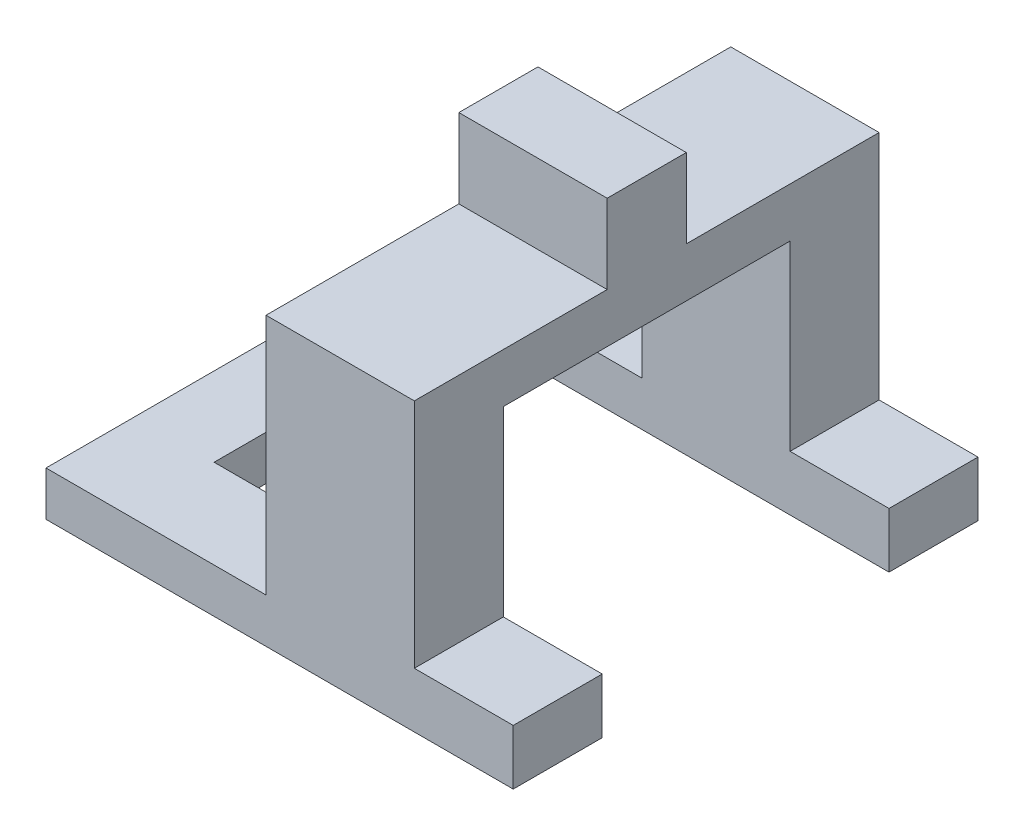
ISO-10303-21;
HEADER;
FILE_DESCRIPTION(('STEP AP214'),'2;1');
FILE_NAME('part.step','',(''),(''),'','','');
FILE_SCHEMA(('AUTOMOTIVE_DESIGN { 1 0 10303 214 1 1 1 1 }'));
ENDSEC;
DATA;
#1=APPLICATION_CONTEXT('core data for automotive mechanical design processes');
#2=APPLICATION_PROTOCOL_DEFINITION('international standard','automotive_design',2000,#1);
#3=PRODUCT_CONTEXT('',#1,'mechanical');
#4=PRODUCT('Part','Part','',(#3));
#5=PRODUCT_RELATED_PRODUCT_CATEGORY('part','',(#4));
#6=PRODUCT_DEFINITION_FORMATION('','',#4);
#7=PRODUCT_DEFINITION_CONTEXT('part definition',#1,'design');
#8=PRODUCT_DEFINITION('design','',#6,#7);
#9=PRODUCT_DEFINITION_SHAPE('','',#8);
#10=(LENGTH_UNIT() NAMED_UNIT(*) SI_UNIT(.MILLI.,.METRE.));
#11=(NAMED_UNIT(*) PLANE_ANGLE_UNIT() SI_UNIT($,.RADIAN.));
#12=(NAMED_UNIT(*) SI_UNIT($,.STERADIAN.) SOLID_ANGLE_UNIT());
#13=UNCERTAINTY_MEASURE_WITH_UNIT(LENGTH_MEASURE(1.E-05),#10,'distance_accuracy_value','');
#14=(GEOMETRIC_REPRESENTATION_CONTEXT(3) GLOBAL_UNCERTAINTY_ASSIGNED_CONTEXT((#13)) GLOBAL_UNIT_ASSIGNED_CONTEXT((#10,
#11,#12)) REPRESENTATION_CONTEXT('',''));
#15=CARTESIAN_POINT('',(0.,0.,0.));
#16=DIRECTION('',(0.,0.,1.));
#17=DIRECTION('',(1.,0.,0.));
#18=AXIS2_PLACEMENT_3D('',#15,#16,#17);
#19=CARTESIAN_POINT('',(18.1892801932367,-25.6304347826087,47.));
#20=DIRECTION('',(-1.,0.,0.));
#21=DIRECTION('',(0.,0.,1.));
#22=AXIS2_PLACEMENT_3D('',#19,#20,#21);
#23=PLANE('',#22);
#24=DIRECTION('',(0.,0.,-1.));
#25=VECTOR('',#24,1.);
#26=CARTESIAN_POINT('',(18.1892801932367,-25.6304347826087,47.));
#27=LINE('',#26,#25);
#28=CARTESIAN_POINT('',(18.1892801932367,-25.6304347826087,47.));
#29=VERTEX_POINT('',#28);
#30=CARTESIAN_POINT('',(18.1892801932367,-25.6304347826087,38.));
#31=VERTEX_POINT('',#30);
#32=EDGE_CURVE('E192',#29,#31,#27,.T.);
#33=ORIENTED_EDGE('',*,*,#32,.T.);
#34=DIRECTION('',(0.,-1.,0.));
#35=VECTOR('',#34,1.);
#36=CARTESIAN_POINT('',(18.1892801932367,-25.6304347826087,38.));
#37=LINE('',#36,#35);
#38=CARTESIAN_POINT('',(18.1892801932367,-20.0504347826087,38.));
#39=VERTEX_POINT('',#38);
#40=EDGE_CURVE('E133',#39,#31,#37,.T.);
#41=ORIENTED_EDGE('',*,*,#40,.F.);
#42=DIRECTION('',(0.,0.,-1.));
#43=VECTOR('',#42,1.);
#44=CARTESIAN_POINT('',(18.1892801932367,-20.0504347826087,47.));
#45=LINE('',#44,#43);
#46=CARTESIAN_POINT('',(18.1892801932367,-20.0504347826087,47.));
#47=VERTEX_POINT('',#46);
#48=EDGE_CURVE('E130',#47,#39,#45,.T.);
#49=ORIENTED_EDGE('',*,*,#48,.F.);
#50=DIRECTION('',(0.,1.,0.));
#51=VECTOR('',#50,1.);
#52=CARTESIAN_POINT('',(18.1892801932367,-25.6304347826087,47.));
#53=LINE('',#52,#51);
#54=EDGE_CURVE('E116',#29,#47,#53,.T.);
#55=ORIENTED_EDGE('',*,*,#54,.F.);
#56=EDGE_LOOP('',(#33,#41,#49,#55));
#57=FACE_BOUND('',#56,.T.);
#58=ADVANCED_FACE('F33',(#57),#23,.F.);
#59=CARTESIAN_POINT('',(18.1892801932367,-20.0504347826087,47.));
#60=DIRECTION('',(0.,-1.,0.));
#61=DIRECTION('',(0.,0.,-1.));
#62=AXIS2_PLACEMENT_3D('',#59,#60,#61);
#63=PLANE('',#62);
#64=ORIENTED_EDGE('',*,*,#48,.T.);
#65=DIRECTION('',(1.,0.,0.));
#66=VECTOR('',#65,1.);
#67=CARTESIAN_POINT('',(-21.0607198067633,-20.0504347826087,38.));
#68=LINE('',#67,#66);
#69=CARTESIAN_POINT('',(8.18928019323672,-20.0504347826087,38.));
#70=VERTEX_POINT('',#69);
#71=EDGE_CURVE('E332',#70,#39,#68,.T.);
#72=ORIENTED_EDGE('',*,*,#71,.F.);
#73=DIRECTION('',(0.,0.,-1.));
#74=VECTOR('',#73,1.);
#75=CARTESIAN_POINT('',(8.18928019323672,-20.0504347826087,47.));
#76=LINE('',#75,#74);
#77=CARTESIAN_POINT('',(8.18928019323672,-20.0504347826087,47.));
#78=VERTEX_POINT('',#77);
#79=EDGE_CURVE('E141',#78,#70,#76,.T.);
#80=ORIENTED_EDGE('',*,*,#79,.F.);
#81=DIRECTION('',(-1.,0.,0.));
#82=VECTOR('',#81,1.);
#83=CARTESIAN_POINT('',(18.1892801932367,-20.0504347826087,47.));
#84=LINE('',#83,#82);
#85=EDGE_CURVE('E120',#47,#78,#84,.T.);
#86=ORIENTED_EDGE('',*,*,#85,.F.);
#87=EDGE_LOOP('',(#64,#72,#80,#86));
#88=FACE_BOUND('',#87,.T.);
#89=ADVANCED_FACE('F139',(#88),#63,.F.);
#90=CARTESIAN_POINT('',(-6.81071980676328,3.36956521739131,47.));
#91=DIRECTION('',(0.,-1.,0.));
#92=DIRECTION('',(0.,0.,-1.));
#93=AXIS2_PLACEMENT_3D('',#90,#91,#92);
#94=PLANE('',#93);
#95=DIRECTION('',(1.,0.,0.));
#96=VECTOR('',#95,1.);
#97=CARTESIAN_POINT('',(-6.81071980676328,3.3695652173913,27.5));
#98=LINE('',#97,#96);
#99=CARTESIAN_POINT('',(-6.81071980676328,3.3695652173913,27.5));
#100=VERTEX_POINT('',#99);
#101=CARTESIAN_POINT('',(8.18928019323672,3.36956521739131,27.5));
#102=VERTEX_POINT('',#101);
#103=EDGE_CURVE('E270',#100,#102,#98,.T.);
#104=ORIENTED_EDGE('',*,*,#103,.F.);
#105=DIRECTION('',(0.,0.,-1.));
#106=VECTOR('',#105,1.);
#107=CARTESIAN_POINT('',(-6.81071980676328,3.36956521739131,47.));
#108=LINE('',#107,#106);
#109=CARTESIAN_POINT('',(-6.81071980676328,3.36956521739131,47.));
#110=VERTEX_POINT('',#109);
#111=EDGE_CURVE('E11',#110,#100,#108,.T.);
#112=ORIENTED_EDGE('',*,*,#111,.F.);
#113=DIRECTION('',(-1.,0.,0.));
#114=VECTOR('',#113,1.);
#115=CARTESIAN_POINT('',(-6.81071980676328,3.36956521739131,47.));
#116=LINE('',#115,#114);
#117=CARTESIAN_POINT('',(8.18928019323672,3.36956521739131,47.));
#118=VERTEX_POINT('',#117);
#119=EDGE_CURVE('E167',#118,#110,#116,.T.);
#120=ORIENTED_EDGE('',*,*,#119,.F.);
#121=DIRECTION('',(0.,0.,-1.));
#122=VECTOR('',#121,1.);
#123=CARTESIAN_POINT('',(8.18928019323672,3.36956521739131,47.));
#124=LINE('',#123,#122);
#125=EDGE_CURVE('E174',#118,#102,#124,.T.);
#126=ORIENTED_EDGE('',*,*,#125,.T.);
#127=EDGE_LOOP('',(#104,#112,#120,#126));
#128=FACE_BOUND('',#127,.T.);
#129=ADVANCED_FACE('F295',(#128),#94,.F.);
#130=CARTESIAN_POINT('',(-6.81071980676328,3.3695652173913,19.5));
#131=VERTEX_POINT('',#130);
#132=CARTESIAN_POINT('',(-6.81071980676328,3.36956521739131,0.));
#133=VERTEX_POINT('',#132);
#134=EDGE_CURVE('E42',#131,#133,#108,.T.);
#135=ORIENTED_EDGE('',*,*,#134,.F.);
#136=DIRECTION('',(1.,0.,0.));
#137=VECTOR('',#136,1.);
#138=CARTESIAN_POINT('',(-6.81071980676328,3.3695652173913,19.5));
#139=LINE('',#138,#137);
#140=CARTESIAN_POINT('',(8.18928019323672,3.36956521739131,19.5));
#141=VERTEX_POINT('',#140);
#142=EDGE_CURVE('E149',#131,#141,#139,.T.);
#143=ORIENTED_EDGE('',*,*,#142,.T.);
#144=CARTESIAN_POINT('',(8.18928019323672,3.36956521739131,0.));
#145=VERTEX_POINT('',#144);
#146=EDGE_CURVE('E92',#141,#145,#124,.T.);
#147=ORIENTED_EDGE('',*,*,#146,.T.);
#148=DIRECTION('',(-1.,0.,0.));
#149=VECTOR('',#148,1.);
#150=CARTESIAN_POINT('',(-6.81071980676328,3.36956521739131,0.));
#151=LINE('',#150,#149);
#152=EDGE_CURVE('E146',#145,#133,#151,.T.);
#153=ORIENTED_EDGE('',*,*,#152,.T.);
#154=EDGE_LOOP('',(#135,#143,#147,#153));
#155=FACE_BOUND('',#154,.T.);
#156=ADVANCED_FACE('F35',(#155),#94,.F.);
#157=CARTESIAN_POINT('',(-6.81071980676328,3.36956521739131,47.));
#158=DIRECTION('',(1.,0.,0.));
#159=DIRECTION('',(0.,1.,0.));
#160=AXIS2_PLACEMENT_3D('',#157,#158,#159);
#161=PLANE('',#160);
#162=DIRECTION('',(0.,-1.,0.));
#163=VECTOR('',#162,1.);
#164=CARTESIAN_POINT('',(-6.81071980676328,-1.6304347826087,38.));
#165=LINE('',#164,#163);
#166=CARTESIAN_POINT('',(-6.81071980676328,-1.6304347826087,38.));
#167=VERTEX_POINT('',#166);
#168=CARTESIAN_POINT('',(-6.81071980676328,-21.1304347826087,38.));
#169=VERTEX_POINT('',#168);
#170=EDGE_CURVE('E240',#167,#169,#165,.T.);
#171=ORIENTED_EDGE('',*,*,#170,.T.);
#172=DIRECTION('',(0.,0.,-1.));
#173=VECTOR('',#172,1.);
#174=CARTESIAN_POINT('',(-6.81071980676328,-21.1304347826087,47.));
#175=LINE('',#174,#173);
#176=CARTESIAN_POINT('',(-6.81071980676328,-21.1304347826087,47.));
#177=VERTEX_POINT('',#176);
#178=EDGE_CURVE('E179',#177,#169,#175,.T.);
#179=ORIENTED_EDGE('',*,*,#178,.F.);
#180=DIRECTION('',(0.,-1.,0.));
#181=VECTOR('',#180,1.);
#182=CARTESIAN_POINT('',(-6.81071980676328,3.36956521739131,47.));
#183=LINE('',#182,#181);
#184=EDGE_CURVE('E100',#110,#177,#183,.T.);
#185=ORIENTED_EDGE('',*,*,#184,.F.);
#186=ORIENTED_EDGE('',*,*,#111,.T.);
#187=DIRECTION('',(0.,-1.,0.));
#188=VECTOR('',#187,1.);
#189=CARTESIAN_POINT('',(-6.81071980676328,0.,27.5));
#190=LINE('',#189,#188);
#191=CARTESIAN_POINT('',(-6.81071980676328,11.3695652173913,27.5));
#192=VERTEX_POINT('',#191);
#193=EDGE_CURVE('E257',#192,#100,#190,.T.);
#194=ORIENTED_EDGE('',*,*,#193,.F.);
#195=DIRECTION('',(0.,0.,1.));
#196=VECTOR('',#195,1.);
#197=CARTESIAN_POINT('',(-6.81071980676328,11.3695652173913,0.));
#198=LINE('',#197,#196);
#199=CARTESIAN_POINT('',(-6.81071980676328,11.3695652173913,19.5));
#200=VERTEX_POINT('',#199);
#201=EDGE_CURVE('E254',#200,#192,#198,.T.);
#202=ORIENTED_EDGE('',*,*,#201,.F.);
#203=DIRECTION('',(0.,-1.,0.));
#204=VECTOR('',#203,1.);
#205=CARTESIAN_POINT('',(-6.81071980676328,0.,19.5));
#206=LINE('',#205,#204);
#207=EDGE_CURVE('E258',#200,#131,#206,.T.);
#208=ORIENTED_EDGE('',*,*,#207,.T.);
#209=ORIENTED_EDGE('',*,*,#134,.T.);
#210=DIRECTION('',(0.,-1.,0.));
#211=VECTOR('',#210,1.);
#212=CARTESIAN_POINT('',(-6.81071980676328,3.36956521739131,0.));
#213=LINE('',#212,#211);
#214=CARTESIAN_POINT('',(-6.81071980676328,-21.1304347826087,0.));
#215=VERTEX_POINT('',#214);
#216=EDGE_CURVE('E148',#133,#215,#213,.T.);
#217=ORIENTED_EDGE('',*,*,#216,.T.);
#218=CARTESIAN_POINT('',(-6.81071980676328,-21.1304347826087,9.));
#219=VERTEX_POINT('',#218);
#220=EDGE_CURVE('E185',#219,#215,#175,.T.);
#221=ORIENTED_EDGE('',*,*,#220,.F.);
#222=DIRECTION('',(0.,1.,0.));
#223=VECTOR('',#222,1.);
#224=CARTESIAN_POINT('',(-6.81071980676328,-1.6304347826087,9.));
#225=LINE('',#224,#223);
#226=CARTESIAN_POINT('',(-6.81071980676328,-1.6304347826087,9.));
#227=VERTEX_POINT('',#226);
#228=EDGE_CURVE('E339',#219,#227,#225,.T.);
#229=ORIENTED_EDGE('',*,*,#228,.T.);
#230=DIRECTION('',(0.,0.,1.));
#231=VECTOR('',#230,1.);
#232=CARTESIAN_POINT('',(-6.81071980676328,-1.6304347826087,38.));
#233=LINE('',#232,#231);
#234=EDGE_CURVE('E253',#227,#167,#233,.T.);
#235=ORIENTED_EDGE('',*,*,#234,.T.);
#236=EDGE_LOOP('',(#171,#179,#185,#186,#194,#202,#208,#209,#217,#221,#229,#235));
#237=FACE_BOUND('',#236,.T.);
#238=ADVANCED_FACE('F344',(#237),#161,.F.);
#239=CARTESIAN_POINT('',(-29.0583098230278,-21.1304347826087,47.));
#240=DIRECTION('',(0.,-1.,0.));
#241=DIRECTION('',(0.,0.,-1.));
#242=AXIS2_PLACEMENT_3D('',#239,#240,#241);
#243=PLANE('',#242);
#244=CARTESIAN_POINT('',(-25.0595148148955,-21.1304347826087,23.5));
#245=DIRECTION('',(0.,1.,0.));
#246=DIRECTION('',(0.,0.,1.));
#247=AXIS2_PLACEMENT_3D('',#244,#245,#246);
#248=CIRCLE('',#247,1.4);
#249=CARTESIAN_POINT('',(-25.0595148148955,-21.1304347826087,24.9));
#250=VERTEX_POINT('',#249);
#251=EDGE_CURVE('E443',#250,#250,#248,.T.);
#252=ORIENTED_EDGE('',*,*,#251,.F.);
#253=EDGE_LOOP('',(#252));
#254=FACE_BOUND('',#253,.T.);
#255=ORIENTED_EDGE('',*,*,#178,.T.);
#256=DIRECTION('',(-1.,0.,0.));
#257=VECTOR('',#256,1.);
#258=CARTESIAN_POINT('',(-29.0583098230278,-21.1304347826087,38.));
#259=LINE('',#258,#257);
#260=CARTESIAN_POINT('',(-21.0607198067633,-21.1304347826087,38.));
#261=VERTEX_POINT('',#260);
#262=EDGE_CURVE('E331',#169,#261,#259,.T.);
#263=ORIENTED_EDGE('',*,*,#262,.T.);
#264=DIRECTION('',(0.,0.,-1.));
#265=VECTOR('',#264,1.);
#266=CARTESIAN_POINT('',(-21.0607198067633,-21.1304347826087,47.));
#267=LINE('',#266,#265);
#268=CARTESIAN_POINT('',(-21.0607198067633,-21.1304347826087,9.));
#269=VERTEX_POINT('',#268);
#270=EDGE_CURVE('E243',#261,#269,#267,.T.);
#271=ORIENTED_EDGE('',*,*,#270,.T.);
#272=DIRECTION('',(1.,0.,0.));
#273=VECTOR('',#272,1.);
#274=CARTESIAN_POINT('',(-29.0583098230278,-21.1304347826087,9.));
#275=LINE('',#274,#273);
#276=EDGE_CURVE('E328',#269,#219,#275,.T.);
#277=ORIENTED_EDGE('',*,*,#276,.T.);
#278=ORIENTED_EDGE('',*,*,#220,.T.);
#279=DIRECTION('',(-1.,0.,0.));
#280=VECTOR('',#279,1.);
#281=CARTESIAN_POINT('',(-29.0583098230278,-21.1304347826087,0.));
#282=LINE('',#281,#280);
#283=CARTESIAN_POINT('',(-29.0583098230278,-21.1304347826087,0.));
#284=VERTEX_POINT('',#283);
#285=EDGE_CURVE('E152',#215,#284,#282,.T.);
#286=ORIENTED_EDGE('',*,*,#285,.T.);
#287=DIRECTION('',(0.,0.,-1.));
#288=VECTOR('',#287,1.);
#289=CARTESIAN_POINT('',(-29.0583098230278,-21.1304347826087,47.));
#290=LINE('',#289,#288);
#291=CARTESIAN_POINT('',(-29.0583098230278,-21.1304347826087,47.));
#292=VERTEX_POINT('',#291);
#293=EDGE_CURVE('E186',#292,#284,#290,.T.);
#294=ORIENTED_EDGE('',*,*,#293,.F.);
#295=DIRECTION('',(-1.,0.,0.));
#296=VECTOR('',#295,1.);
#297=CARTESIAN_POINT('',(-29.0583098230278,-21.1304347826087,47.));
#298=LINE('',#297,#296);
#299=EDGE_CURVE('E299',#177,#292,#298,.T.);
#300=ORIENTED_EDGE('',*,*,#299,.F.);
#301=EDGE_LOOP('',(#255,#263,#271,#277,#278,#286,#294,#300));
#302=FACE_BOUND('',#301,.T.);
#303=ADVANCED_FACE('F403',(#254,#302),#243,.F.);
#304=CARTESIAN_POINT('',(-29.0583098230278,-25.6304347826087,47.));
#305=DIRECTION('',(1.,0.,0.));
#306=DIRECTION('',(0.,0.,-1.));
#307=AXIS2_PLACEMENT_3D('',#304,#305,#306);
#308=PLANE('',#307);
#309=DIRECTION('',(0.,-1.,0.));
#310=VECTOR('',#309,1.);
#311=CARTESIAN_POINT('',(-29.0583098230278,-25.6304347826087,0.));
#312=LINE('',#311,#310);
#313=CARTESIAN_POINT('',(-29.0583098230278,-25.6304347826087,0.));
#314=VERTEX_POINT('',#313);
#315=EDGE_CURVE('E154',#284,#314,#312,.T.);
#316=ORIENTED_EDGE('',*,*,#315,.T.);
#317=DIRECTION('',(0.,0.,-1.));
#318=VECTOR('',#317,1.);
#319=CARTESIAN_POINT('',(-29.0583098230278,-25.6304347826087,47.));
#320=LINE('',#319,#318);
#321=CARTESIAN_POINT('',(-29.0583098230278,-25.6304347826087,47.));
#322=VERTEX_POINT('',#321);
#323=EDGE_CURVE('E189',#322,#314,#320,.T.);
#324=ORIENTED_EDGE('',*,*,#323,.F.);
#325=DIRECTION('',(0.,-1.,0.));
#326=VECTOR('',#325,1.);
#327=CARTESIAN_POINT('',(-29.0583098230278,-25.6304347826087,47.));
#328=LINE('',#327,#326);
#329=EDGE_CURVE('E304',#292,#322,#328,.T.);
#330=ORIENTED_EDGE('',*,*,#329,.F.);
#331=ORIENTED_EDGE('',*,*,#293,.T.);
#332=EDGE_LOOP('',(#316,#324,#330,#331));
#333=FACE_BOUND('',#332,.T.);
#334=ADVANCED_FACE('F309',(#333),#308,.F.);
#335=CARTESIAN_POINT('',(-29.0583098230278,-25.6304347826087,47.));
#336=DIRECTION('',(0.,1.,0.));
#337=DIRECTION('',(0.,0.,1.));
#338=AXIS2_PLACEMENT_3D('',#335,#336,#337);
#339=PLANE('',#338);
#340=CARTESIAN_POINT('',(-25.0595148148955,-25.6304347826087,23.5));
#341=DIRECTION('',(0.,1.,0.));
#342=DIRECTION('',(0.,0.,1.));
#343=AXIS2_PLACEMENT_3D('',#340,#341,#342);
#344=CIRCLE('',#343,1.4);
#345=CARTESIAN_POINT('',(-25.0595148148955,-25.6304347826087,24.9));
#346=VERTEX_POINT('',#345);
#347=EDGE_CURVE('E37',#346,#346,#344,.T.);
#348=ORIENTED_EDGE('',*,*,#347,.T.);
#349=EDGE_LOOP('',(#348));
#350=FACE_BOUND('',#349,.T.);
#351=DIRECTION('',(0.,0.,-1.));
#352=VECTOR('',#351,1.);
#353=CARTESIAN_POINT('',(-21.0607198067633,-25.6304347826087,9.));
#354=LINE('',#353,#352);
#355=CARTESIAN_POINT('',(-21.0607198067633,-25.6304347826087,38.));
#356=VERTEX_POINT('',#355);
#357=CARTESIAN_POINT('',(-21.0607198067633,-25.6304347826087,9.));
#358=VERTEX_POINT('',#357);
#359=EDGE_CURVE('E315',#356,#358,#354,.T.);
#360=ORIENTED_EDGE('',*,*,#359,.F.);
#361=DIRECTION('',(1.,0.,0.));
#362=VECTOR('',#361,1.);
#363=CARTESIAN_POINT('',(-21.0607198067633,-25.6304347826087,38.));
#364=LINE('',#363,#362);
#365=EDGE_CURVE('E312',#356,#31,#364,.T.);
#366=ORIENTED_EDGE('',*,*,#365,.T.);
#367=ORIENTED_EDGE('',*,*,#32,.F.);
#368=DIRECTION('',(1.,0.,0.));
#369=VECTOR('',#368,1.);
#370=CARTESIAN_POINT('',(-29.0583098230278,-25.6304347826087,47.));
#371=LINE('',#370,#369);
#372=EDGE_CURVE('E123',#322,#29,#371,.T.);
#373=ORIENTED_EDGE('',*,*,#372,.F.);
#374=ORIENTED_EDGE('',*,*,#323,.T.);
#375=DIRECTION('',(1.,0.,0.));
#376=VECTOR('',#375,1.);
#377=CARTESIAN_POINT('',(-29.0583098230278,-25.6304347826087,0.));
#378=LINE('',#377,#376);
#379=CARTESIAN_POINT('',(18.1892801932367,-25.6304347826087,0.));
#380=VERTEX_POINT('',#379);
#381=EDGE_CURVE('E156',#314,#380,#378,.T.);
#382=ORIENTED_EDGE('',*,*,#381,.T.);
#383=CARTESIAN_POINT('',(18.1892801932367,-25.6304347826087,9.));
#384=VERTEX_POINT('',#383);
#385=EDGE_CURVE('E136',#384,#380,#27,.T.);
#386=ORIENTED_EDGE('',*,*,#385,.F.);
#387=DIRECTION('',(1.,0.,0.));
#388=VECTOR('',#387,1.);
#389=CARTESIAN_POINT('',(-21.0607198067633,-25.6304347826087,9.));
#390=LINE('',#389,#388);
#391=EDGE_CURVE('E319',#358,#384,#390,.T.);
#392=ORIENTED_EDGE('',*,*,#391,.F.);
#393=EDGE_LOOP('',(#360,#366,#367,#373,#374,#382,#386,#392));
#394=FACE_BOUND('',#393,.T.);
#395=ADVANCED_FACE('F208',(#350,#394),#339,.F.);
#396=CARTESIAN_POINT('',(18.1892801932367,-20.0504347826087,9.));
#397=VERTEX_POINT('',#396);
#398=CARTESIAN_POINT('',(18.1892801932367,-20.0504347826087,0.));
#399=VERTEX_POINT('',#398);
#400=EDGE_CURVE('E137',#397,#399,#45,.T.);
#401=ORIENTED_EDGE('',*,*,#400,.F.);
#402=DIRECTION('',(0.,1.,0.));
#403=VECTOR('',#402,1.);
#404=CARTESIAN_POINT('',(18.1892801932367,-20.0504347826087,9.));
#405=LINE('',#404,#403);
#406=EDGE_CURVE('E203',#384,#397,#405,.T.);
#407=ORIENTED_EDGE('',*,*,#406,.F.);
#408=ORIENTED_EDGE('',*,*,#385,.T.);
#409=DIRECTION('',(0.,1.,0.));
#410=VECTOR('',#409,1.);
#411=CARTESIAN_POINT('',(18.1892801932367,-25.6304347826087,0.));
#412=LINE('',#411,#410);
#413=EDGE_CURVE('E159',#380,#399,#412,.T.);
#414=ORIENTED_EDGE('',*,*,#413,.T.);
#415=EDGE_LOOP('',(#401,#407,#408,#414));
#416=FACE_BOUND('',#415,.T.);
#417=ADVANCED_FACE('F198',(#416),#23,.F.);
#418=CARTESIAN_POINT('',(8.18928019323672,-20.0504347826087,9.));
#419=VERTEX_POINT('',#418);
#420=CARTESIAN_POINT('',(8.18928019323672,-20.0504347826087,0.));
#421=VERTEX_POINT('',#420);
#422=EDGE_CURVE('E177',#419,#421,#76,.T.);
#423=ORIENTED_EDGE('',*,*,#422,.F.);
#424=DIRECTION('',(1.,0.,0.));
#425=VECTOR('',#424,1.);
#426=CARTESIAN_POINT('',(-21.0607198067633,-20.0504347826087,9.));
#427=LINE('',#426,#425);
#428=EDGE_CURVE('E222',#419,#397,#427,.T.);
#429=ORIENTED_EDGE('',*,*,#428,.T.);
#430=ORIENTED_EDGE('',*,*,#400,.T.);
#431=DIRECTION('',(-1.,0.,0.));
#432=VECTOR('',#431,1.);
#433=CARTESIAN_POINT('',(18.1892801932367,-20.0504347826087,0.));
#434=LINE('',#433,#432);
#435=EDGE_CURVE('E162',#399,#421,#434,.T.);
#436=ORIENTED_EDGE('',*,*,#435,.T.);
#437=EDGE_LOOP('',(#423,#429,#430,#436));
#438=FACE_BOUND('',#437,.T.);
#439=ADVANCED_FACE('F217',(#438),#63,.F.);
#440=CARTESIAN_POINT('',(8.18928019323672,3.36956521739131,47.));
#441=DIRECTION('',(-1.,0.,0.));
#442=DIRECTION('',(0.,-1.,0.));
#443=AXIS2_PLACEMENT_3D('',#440,#441,#442);
#444=PLANE('',#443);
#445=ORIENTED_EDGE('',*,*,#79,.T.);
#446=DIRECTION('',(0.,-1.,0.));
#447=VECTOR('',#446,1.);
#448=CARTESIAN_POINT('',(8.18928019323672,-1.63043478260869,38.));
#449=LINE('',#448,#447);
#450=CARTESIAN_POINT('',(8.18928019323672,-1.63043478260869,38.));
#451=VERTEX_POINT('',#450);
#452=EDGE_CURVE('E238',#451,#70,#449,.T.);
#453=ORIENTED_EDGE('',*,*,#452,.F.);
#454=DIRECTION('',(0.,0.,1.));
#455=VECTOR('',#454,1.);
#456=CARTESIAN_POINT('',(8.18928019323672,-1.63043478260869,38.));
#457=LINE('',#456,#455);
#458=CARTESIAN_POINT('',(8.18928019323672,-1.63043478260869,9.));
#459=VERTEX_POINT('',#458);
#460=EDGE_CURVE('E233',#459,#451,#457,.T.);
#461=ORIENTED_EDGE('',*,*,#460,.F.);
#462=DIRECTION('',(0.,1.,0.));
#463=VECTOR('',#462,1.);
#464=CARTESIAN_POINT('',(8.18928019323672,-1.63043478260869,9.));
#465=LINE('',#464,#463);
#466=EDGE_CURVE('E230',#419,#459,#465,.T.);
#467=ORIENTED_EDGE('',*,*,#466,.F.);
#468=ORIENTED_EDGE('',*,*,#422,.T.);
#469=DIRECTION('',(0.,1.,0.));
#470=VECTOR('',#469,1.);
#471=CARTESIAN_POINT('',(8.18928019323672,3.36956521739131,0.));
#472=LINE('',#471,#470);
#473=EDGE_CURVE('E165',#421,#145,#472,.T.);
#474=ORIENTED_EDGE('',*,*,#473,.T.);
#475=ORIENTED_EDGE('',*,*,#146,.F.);
#476=DIRECTION('',(0.,-1.,0.));
#477=VECTOR('',#476,1.);
#478=CARTESIAN_POINT('',(8.18928019323672,0.,19.5));
#479=LINE('',#478,#477);
#480=CARTESIAN_POINT('',(8.18928019323672,11.3695652173913,19.5));
#481=VERTEX_POINT('',#480);
#482=EDGE_CURVE('E50',#481,#141,#479,.T.);
#483=ORIENTED_EDGE('',*,*,#482,.F.);
#484=DIRECTION('',(0.,0.,1.));
#485=VECTOR('',#484,1.);
#486=CARTESIAN_POINT('',(8.18928019323672,11.3695652173913,0.));
#487=LINE('',#486,#485);
#488=CARTESIAN_POINT('',(8.18928019323672,11.3695652173913,27.5));
#489=VERTEX_POINT('',#488);
#490=EDGE_CURVE('E259',#481,#489,#487,.T.);
#491=ORIENTED_EDGE('',*,*,#490,.T.);
#492=DIRECTION('',(0.,-1.,0.));
#493=VECTOR('',#492,1.);
#494=CARTESIAN_POINT('',(8.18928019323672,0.,27.5));
#495=LINE('',#494,#493);
#496=EDGE_CURVE('E262',#489,#102,#495,.T.);
#497=ORIENTED_EDGE('',*,*,#496,.T.);
#498=ORIENTED_EDGE('',*,*,#125,.F.);
#499=DIRECTION('',(0.,1.,0.));
#500=VECTOR('',#499,1.);
#501=CARTESIAN_POINT('',(8.18928019323672,3.36956521739131,47.));
#502=LINE('',#501,#500);
#503=EDGE_CURVE('E59',#78,#118,#502,.T.);
#504=ORIENTED_EDGE('',*,*,#503,.F.);
#505=EDGE_LOOP('',(#445,#453,#461,#467,#468,#474,#475,#483,#491,#497,#498,#504));
#506=FACE_BOUND('',#505,.T.);
#507=ADVANCED_FACE('F227',(#506),#444,.F.);
#508=CARTESIAN_POINT('',(0.,0.,47.));
#509=DIRECTION('',(0.,0.,-1.));
#510=DIRECTION('',(-1.,0.,0.));
#511=AXIS2_PLACEMENT_3D('',#508,#509,#510);
#512=PLANE('',#511);
#513=ORIENTED_EDGE('',*,*,#119,.T.);
#514=ORIENTED_EDGE('',*,*,#184,.T.);
#515=ORIENTED_EDGE('',*,*,#299,.T.);
#516=ORIENTED_EDGE('',*,*,#329,.T.);
#517=ORIENTED_EDGE('',*,*,#372,.T.);
#518=ORIENTED_EDGE('',*,*,#54,.T.);
#519=ORIENTED_EDGE('',*,*,#85,.T.);
#520=ORIENTED_EDGE('',*,*,#503,.T.);
#521=EDGE_LOOP('',(#513,#514,#515,#516,#517,#518,#519,#520));
#522=FACE_BOUND('',#521,.T.);
#523=ADVANCED_FACE('F118',(#522),#512,.F.);
#524=CARTESIAN_POINT('',(0.,0.,0.));
#525=DIRECTION('',(0.,0.,-1.));
#526=DIRECTION('',(-1.,0.,0.));
#527=AXIS2_PLACEMENT_3D('',#524,#525,#526);
#528=PLANE('',#527);
#529=ORIENTED_EDGE('',*,*,#152,.F.);
#530=ORIENTED_EDGE('',*,*,#473,.F.);
#531=ORIENTED_EDGE('',*,*,#435,.F.);
#532=ORIENTED_EDGE('',*,*,#413,.F.);
#533=ORIENTED_EDGE('',*,*,#381,.F.);
#534=ORIENTED_EDGE('',*,*,#315,.F.);
#535=ORIENTED_EDGE('',*,*,#285,.F.);
#536=ORIENTED_EDGE('',*,*,#216,.F.);
#537=EDGE_LOOP('',(#529,#530,#531,#532,#533,#534,#535,#536));
#538=FACE_BOUND('',#537,.T.);
#539=ADVANCED_FACE('F213',(#538),#528,.T.);
#540=CARTESIAN_POINT('',(-6.81071980676328,0.,19.5));
#541=DIRECTION('',(0.,0.,1.));
#542=DIRECTION('',(0.,-1.,0.));
#543=AXIS2_PLACEMENT_3D('',#540,#541,#542);
#544=PLANE('',#543);
#545=ORIENTED_EDGE('',*,*,#482,.T.);
#546=ORIENTED_EDGE('',*,*,#142,.F.);
#547=ORIENTED_EDGE('',*,*,#207,.F.);
#548=DIRECTION('',(1.,0.,0.));
#549=VECTOR('',#548,1.);
#550=CARTESIAN_POINT('',(-6.81071980676328,11.3695652173913,19.5));
#551=LINE('',#550,#549);
#552=EDGE_CURVE('E281',#200,#481,#551,.T.);
#553=ORIENTED_EDGE('',*,*,#552,.T.);
#554=EDGE_LOOP('',(#545,#546,#547,#553));
#555=FACE_BOUND('',#554,.T.);
#556=ADVANCED_FACE('F374',(#555),#544,.F.);
#557=CARTESIAN_POINT('',(-6.81071980676328,0.,27.5));
#558=DIRECTION('',(0.,0.,1.));
#559=DIRECTION('',(1.,0.,0.));
#560=AXIS2_PLACEMENT_3D('',#557,#558,#559);
#561=PLANE('',#560);
#562=ORIENTED_EDGE('',*,*,#496,.F.);
#563=DIRECTION('',(1.,0.,0.));
#564=VECTOR('',#563,1.);
#565=CARTESIAN_POINT('',(-6.81071980676328,11.3695652173913,27.5));
#566=LINE('',#565,#564);
#567=EDGE_CURVE('E278',#192,#489,#566,.T.);
#568=ORIENTED_EDGE('',*,*,#567,.F.);
#569=ORIENTED_EDGE('',*,*,#193,.T.);
#570=ORIENTED_EDGE('',*,*,#103,.T.);
#571=EDGE_LOOP('',(#562,#568,#569,#570));
#572=FACE_BOUND('',#571,.T.);
#573=ADVANCED_FACE('F376',(#572),#561,.T.);
#574=CARTESIAN_POINT('',(-6.81071980676328,11.3695652173913,0.));
#575=DIRECTION('',(0.,1.,0.));
#576=DIRECTION('',(0.,0.,1.));
#577=AXIS2_PLACEMENT_3D('',#574,#575,#576);
#578=PLANE('',#577);
#579=ORIENTED_EDGE('',*,*,#490,.F.);
#580=ORIENTED_EDGE('',*,*,#552,.F.);
#581=ORIENTED_EDGE('',*,*,#201,.T.);
#582=ORIENTED_EDGE('',*,*,#567,.T.);
#583=EDGE_LOOP('',(#579,#580,#581,#582));
#584=FACE_BOUND('',#583,.T.);
#585=ADVANCED_FACE('F370',(#584),#578,.T.);
#586=CARTESIAN_POINT('',(-6.81071980676328,-1.6304347826087,38.));
#587=DIRECTION('',(0.,0.,1.));
#588=DIRECTION('',(1.,0.,0.));
#589=AXIS2_PLACEMENT_3D('',#586,#587,#588);
#590=PLANE('',#589);
#591=ORIENTED_EDGE('',*,*,#452,.T.);
#592=ORIENTED_EDGE('',*,*,#71,.T.);
#593=ORIENTED_EDGE('',*,*,#40,.T.);
#594=ORIENTED_EDGE('',*,*,#365,.F.);
#595=DIRECTION('',(0.,-1.,0.));
#596=VECTOR('',#595,1.);
#597=CARTESIAN_POINT('',(-21.0607198067633,-25.6304347826087,38.));
#598=LINE('',#597,#596);
#599=EDGE_CURVE('E437',#261,#356,#598,.T.);
#600=ORIENTED_EDGE('',*,*,#599,.F.);
#601=ORIENTED_EDGE('',*,*,#262,.F.);
#602=ORIENTED_EDGE('',*,*,#170,.F.);
#603=DIRECTION('',(1.,0.,0.));
#604=VECTOR('',#603,1.);
#605=CARTESIAN_POINT('',(-6.81071980676328,-1.6304347826087,38.));
#606=LINE('',#605,#604);
#607=EDGE_CURVE('E247',#167,#451,#606,.T.);
#608=ORIENTED_EDGE('',*,*,#607,.T.);
#609=EDGE_LOOP('',(#591,#592,#593,#594,#600,#601,#602,#608));
#610=FACE_BOUND('',#609,.T.);
#611=ADVANCED_FACE('F383',(#610),#590,.F.);
#612=CARTESIAN_POINT('',(-6.81071980676328,-1.6304347826087,38.));
#613=DIRECTION('',(0.,1.,0.));
#614=DIRECTION('',(-1.,0.,0.));
#615=AXIS2_PLACEMENT_3D('',#612,#613,#614);
#616=PLANE('',#615);
#617=ORIENTED_EDGE('',*,*,#460,.T.);
#618=ORIENTED_EDGE('',*,*,#607,.F.);
#619=ORIENTED_EDGE('',*,*,#234,.F.);
#620=DIRECTION('',(1.,0.,0.));
#621=VECTOR('',#620,1.);
#622=CARTESIAN_POINT('',(-6.81071980676328,-1.6304347826087,9.));
#623=LINE('',#622,#621);
#624=EDGE_CURVE('E250',#227,#459,#623,.T.);
#625=ORIENTED_EDGE('',*,*,#624,.T.);
#626=EDGE_LOOP('',(#617,#618,#619,#625));
#627=FACE_BOUND('',#626,.T.);
#628=ADVANCED_FACE('F354',(#627),#616,.F.);
#629=CARTESIAN_POINT('',(-6.81071980676328,-1.6304347826087,9.));
#630=DIRECTION('',(0.,0.,-1.));
#631=DIRECTION('',(-1.,0.,0.));
#632=AXIS2_PLACEMENT_3D('',#629,#630,#631);
#633=PLANE('',#632);
#634=ORIENTED_EDGE('',*,*,#466,.T.);
#635=ORIENTED_EDGE('',*,*,#624,.F.);
#636=ORIENTED_EDGE('',*,*,#228,.F.);
#637=ORIENTED_EDGE('',*,*,#276,.F.);
#638=DIRECTION('',(0.,1.,0.));
#639=VECTOR('',#638,1.);
#640=CARTESIAN_POINT('',(-21.0607198067633,-20.0504347826087,9.));
#641=LINE('',#640,#639);
#642=EDGE_CURVE('E320',#358,#269,#641,.T.);
#643=ORIENTED_EDGE('',*,*,#642,.F.);
#644=ORIENTED_EDGE('',*,*,#391,.T.);
#645=ORIENTED_EDGE('',*,*,#406,.T.);
#646=ORIENTED_EDGE('',*,*,#428,.F.);
#647=EDGE_LOOP('',(#634,#635,#636,#637,#643,#644,#645,#646));
#648=FACE_BOUND('',#647,.T.);
#649=ADVANCED_FACE('F450',(#648),#633,.F.);
#650=CARTESIAN_POINT('',(-21.0607198067633,0.,0.));
#651=DIRECTION('',(-1.,0.,0.));
#652=DIRECTION('',(0.,0.,1.));
#653=AXIS2_PLACEMENT_3D('',#650,#651,#652);
#654=PLANE('',#653);
#655=ORIENTED_EDGE('',*,*,#599,.T.);
#656=ORIENTED_EDGE('',*,*,#359,.T.);
#657=ORIENTED_EDGE('',*,*,#642,.T.);
#658=ORIENTED_EDGE('',*,*,#270,.F.);
#659=EDGE_LOOP('',(#655,#656,#657,#658));
#660=FACE_BOUND('',#659,.T.);
#661=ADVANCED_FACE('F438',(#660),#654,.F.);
#662=CARTESIAN_POINT('',(-25.0595148148955,-60.3804347826087,23.5));
#663=DIRECTION('',(0.,1.,0.));
#664=DIRECTION('',(0.,0.,1.));
#665=AXIS2_PLACEMENT_3D('',#662,#663,#664);
#666=CYLINDRICAL_SURFACE('',#665,1.4);
#667=ORIENTED_EDGE('',*,*,#251,.T.);
#668=EDGE_LOOP('',(#667));
#669=FACE_BOUND('',#668,.T.);
#670=ORIENTED_EDGE('',*,*,#347,.F.);
#671=EDGE_LOOP('',(#670));
#672=FACE_BOUND('',#671,.T.);
#673=ADVANCED_FACE('F457',(#669,#672),#666,.F.);
#674=CLOSED_SHELL('',(#58,#89,#129,#156,#238,#303,#334,#395,#417,#439,#507,#523,#539,#556,#573,
#585,#611,#628,#649,#661,#673));
#675=MANIFOLD_SOLID_BREP('B2',#674);
#676=ADVANCED_BREP_SHAPE_REPRESENTATION('',(#18,#675),#14);
#677=SHAPE_DEFINITION_REPRESENTATION(#9,#676);
ENDSEC;
END-ISO-10303-21;
